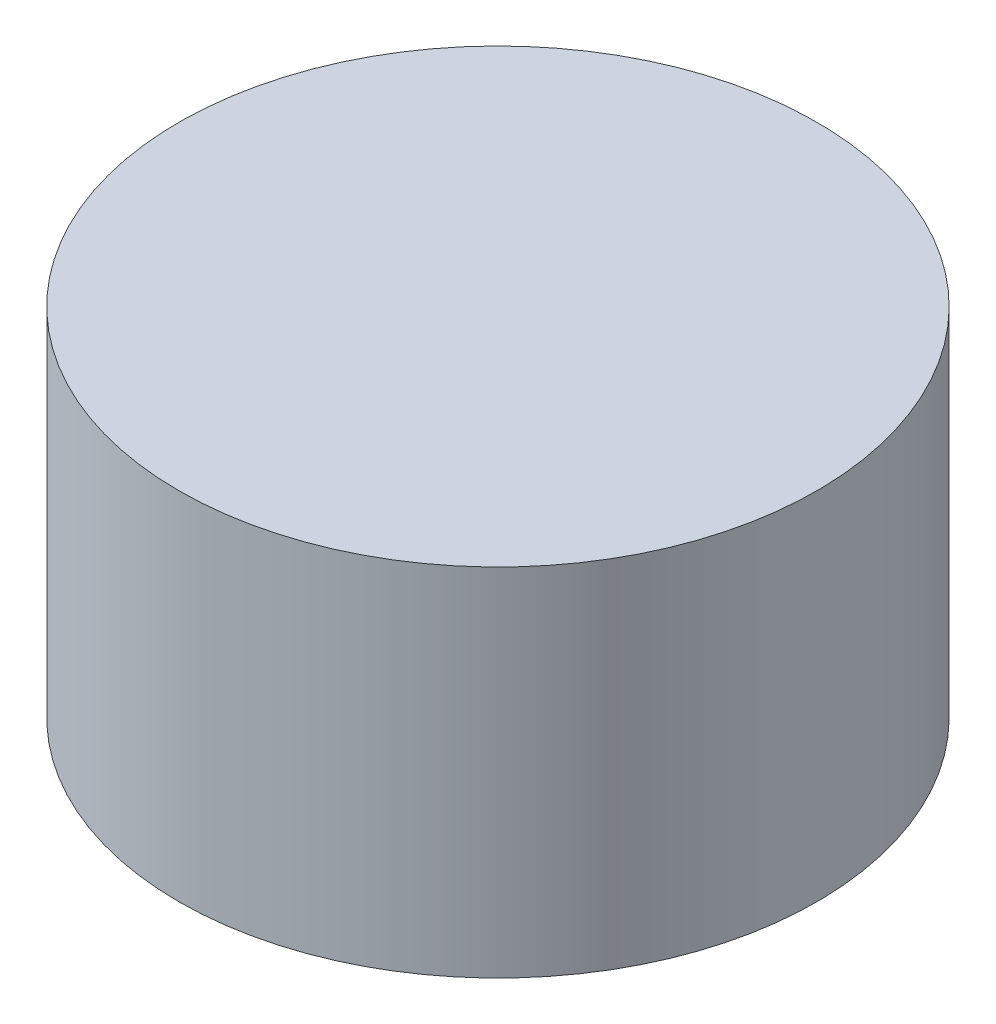
ISO-10303-21;
HEADER;
FILE_DESCRIPTION(('STEP AP214'),'2;1');
FILE_NAME('part.step','',(''),(''),'','','');
FILE_SCHEMA(('AUTOMOTIVE_DESIGN { 1 0 10303 214 1 1 1 1 }'));
ENDSEC;
DATA;
#1=APPLICATION_CONTEXT('core data for automotive mechanical design processes');
#2=APPLICATION_PROTOCOL_DEFINITION('international standard','automotive_design',2000,#1);
#3=PRODUCT_CONTEXT('',#1,'mechanical');
#4=PRODUCT('Part','Part','',(#3));
#5=PRODUCT_RELATED_PRODUCT_CATEGORY('part','',(#4));
#6=PRODUCT_DEFINITION_FORMATION('','',#4);
#7=PRODUCT_DEFINITION_CONTEXT('part definition',#1,'design');
#8=PRODUCT_DEFINITION('design','',#6,#7);
#9=PRODUCT_DEFINITION_SHAPE('','',#8);
#10=(LENGTH_UNIT() NAMED_UNIT(*) SI_UNIT(.MILLI.,.METRE.));
#11=(NAMED_UNIT(*) PLANE_ANGLE_UNIT() SI_UNIT($,.RADIAN.));
#12=(NAMED_UNIT(*) SI_UNIT($,.STERADIAN.) SOLID_ANGLE_UNIT());
#13=UNCERTAINTY_MEASURE_WITH_UNIT(LENGTH_MEASURE(1.E-05),#10,'distance_accuracy_value','');
#14=(GEOMETRIC_REPRESENTATION_CONTEXT(3) GLOBAL_UNCERTAINTY_ASSIGNED_CONTEXT((#13)) GLOBAL_UNIT_ASSIGNED_CONTEXT((#10,
#11,#12)) REPRESENTATION_CONTEXT('',''));
#15=CARTESIAN_POINT('',(0.,0.,0.));
#16=DIRECTION('',(0.,0.,1.));
#17=DIRECTION('',(1.,0.,0.));
#18=AXIS2_PLACEMENT_3D('',#15,#16,#17);
#19=CARTESIAN_POINT('',(0.,5.969,0.));
#20=DIRECTION('',(0.,-1.,0.));
#21=DIRECTION('',(0.,0.,-1.));
#22=AXIS2_PLACEMENT_3D('',#19,#20,#21);
#23=CYLINDRICAL_SURFACE('',#22,5.35);
#24=CARTESIAN_POINT('',(0.,5.969,0.));
#25=DIRECTION('',(0.,1.,0.));
#26=DIRECTION('',(0.,0.,1.));
#27=AXIS2_PLACEMENT_3D('',#24,#25,#26);
#28=CIRCLE('',#27,5.35);
#29=CARTESIAN_POINT('',(0.,5.969,5.35));
#30=VERTEX_POINT('',#29);
#31=EDGE_CURVE('E10',#30,#30,#28,.T.);
#32=ORIENTED_EDGE('',*,*,#31,.F.);
#33=EDGE_LOOP('',(#32));
#34=FACE_BOUND('',#33,.T.);
#35=CARTESIAN_POINT('',(0.,0.,0.));
#36=DIRECTION('',(0.,1.,0.));
#37=DIRECTION('',(0.,0.,1.));
#38=AXIS2_PLACEMENT_3D('',#35,#36,#37);
#39=CIRCLE('',#38,5.35);
#40=CARTESIAN_POINT('',(0.,0.,5.35));
#41=VERTEX_POINT('',#40);
#42=EDGE_CURVE('E33',#41,#41,#39,.T.);
#43=ORIENTED_EDGE('',*,*,#42,.T.);
#44=EDGE_LOOP('',(#43));
#45=FACE_BOUND('',#44,.T.);
#46=ADVANCED_FACE('F30',(#34,#45),#23,.T.);
#47=CARTESIAN_POINT('',(0.,5.969,0.));
#48=DIRECTION('',(0.,1.,0.));
#49=DIRECTION('',(0.,0.,1.));
#50=AXIS2_PLACEMENT_3D('',#47,#48,#49);
#51=PLANE('',#50);
#52=ORIENTED_EDGE('',*,*,#31,.T.);
#53=EDGE_LOOP('',(#52));
#54=FACE_BOUND('',#53,.T.);
#55=ADVANCED_FACE('F45',(#54),#51,.T.);
#56=CARTESIAN_POINT('',(0.,0.,0.));
#57=DIRECTION('',(0.,1.,0.));
#58=DIRECTION('',(0.,0.,1.));
#59=AXIS2_PLACEMENT_3D('',#56,#57,#58);
#60=PLANE('',#59);
#61=ORIENTED_EDGE('',*,*,#42,.F.);
#62=EDGE_LOOP('',(#61));
#63=FACE_BOUND('',#62,.T.);
#64=ADVANCED_FACE('F43',(#63),#60,.F.);
#65=CLOSED_SHELL('',(#46,#55,#64));
#66=MANIFOLD_SOLID_BREP('B2',#65);
#67=ADVANCED_BREP_SHAPE_REPRESENTATION('',(#18,#66),#14);
#68=SHAPE_DEFINITION_REPRESENTATION(#9,#67);
ENDSEC;
END-ISO-10303-21;
